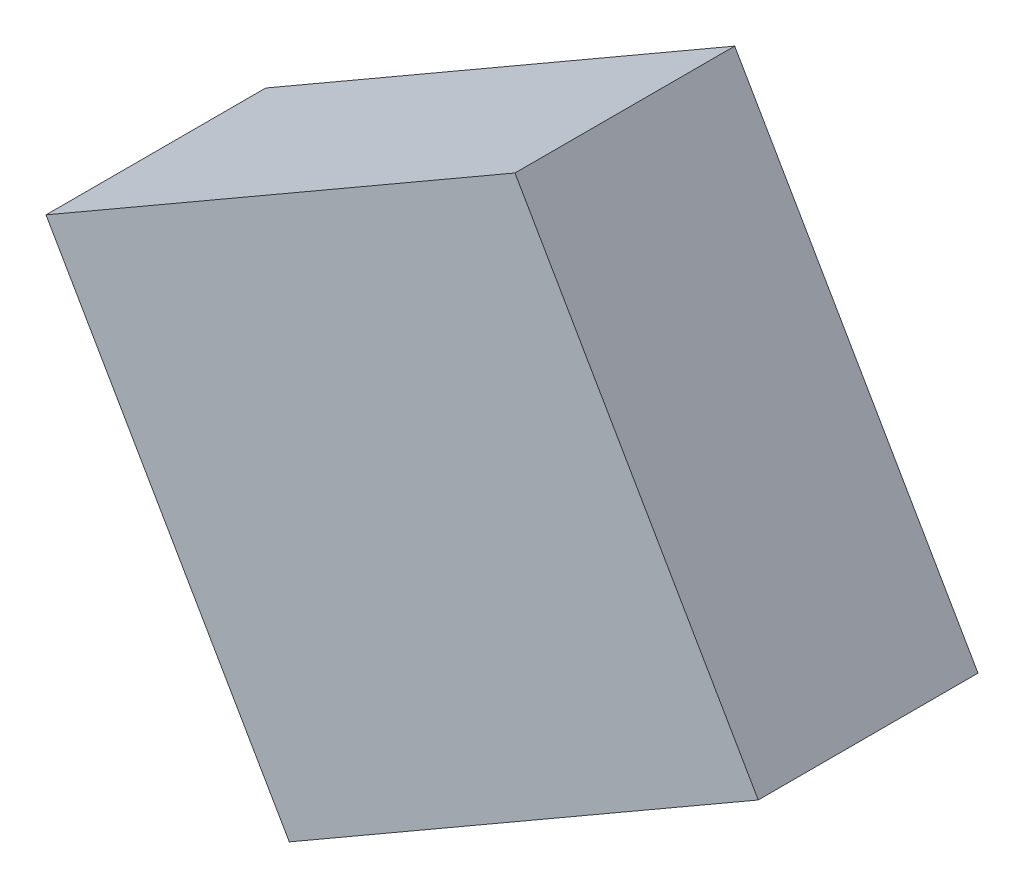
ISO-10303-21;
HEADER;
FILE_DESCRIPTION(('STEP AP214'),'2;1');
FILE_NAME('part.step','',(''),(''),'','','');
FILE_SCHEMA(('AUTOMOTIVE_DESIGN { 1 0 10303 214 1 1 1 1 }'));
ENDSEC;
DATA;
#1=APPLICATION_CONTEXT('core data for automotive mechanical design processes');
#2=APPLICATION_PROTOCOL_DEFINITION('international standard','automotive_design',2000,#1);
#3=PRODUCT_CONTEXT('',#1,'mechanical');
#4=PRODUCT('Part','Part','',(#3));
#5=PRODUCT_RELATED_PRODUCT_CATEGORY('part','',(#4));
#6=PRODUCT_DEFINITION_FORMATION('','',#4);
#7=PRODUCT_DEFINITION_CONTEXT('part definition',#1,'design');
#8=PRODUCT_DEFINITION('design','',#6,#7);
#9=PRODUCT_DEFINITION_SHAPE('','',#8);
#10=(LENGTH_UNIT() NAMED_UNIT(*) SI_UNIT(.MILLI.,.METRE.));
#11=(NAMED_UNIT(*) PLANE_ANGLE_UNIT() SI_UNIT($,.RADIAN.));
#12=(NAMED_UNIT(*) SI_UNIT($,.STERADIAN.) SOLID_ANGLE_UNIT());
#13=UNCERTAINTY_MEASURE_WITH_UNIT(LENGTH_MEASURE(1.E-05),#10,'distance_accuracy_value','');
#14=(GEOMETRIC_REPRESENTATION_CONTEXT(3) GLOBAL_UNCERTAINTY_ASSIGNED_CONTEXT((#13)) GLOBAL_UNIT_ASSIGNED_CONTEXT((#10,
#11,#12)) REPRESENTATION_CONTEXT('',''));
#15=CARTESIAN_POINT('',(0.,0.,0.));
#16=DIRECTION('',(0.,0.,1.));
#17=DIRECTION('',(1.,0.,0.));
#18=AXIS2_PLACEMENT_3D('',#15,#16,#17);
#19=CARTESIAN_POINT('',(2.2688931,-0.47983902,1.39999974));
#20=DIRECTION('',(0.,0.,-1.));
#21=DIRECTION('',(-1.,0.,0.));
#22=AXIS2_PLACEMENT_3D('',#19,#20,#21);
#23=PLANE('',#22);
#24=DIRECTION('',(0.866025294610955,0.500000189093974,0.));
#25=VECTOR('',#24,1.);
#26=CARTESIAN_POINT('',(0.71889366,2.20483938,1.39999974));
#27=LINE('',#26,#25);
#28=CARTESIAN_POINT('',(0.718893659999855,2.20483937999992,1.39999974));
#29=VERTEX_POINT('',#28);
#30=CARTESIAN_POINT('',(-2.26889310000007,0.479839020000115,1.39999974));
#31=VERTEX_POINT('',#30);
#32=EDGE_CURVE('E55',#29,#31,#27,.F.);
#33=ORIENTED_EDGE('',*,*,#32,.T.);
#34=DIRECTION('',(-0.499999913646723,0.866025453640521,0.));
#35=VECTOR('',#34,1.);
#36=CARTESIAN_POINT('',(-2.2688931,0.47983902,1.39999974));
#37=LINE('',#36,#35);
#38=CARTESIAN_POINT('',(-0.718893659999855,-2.20483937999992,1.39999974));
#39=VERTEX_POINT('',#38);
#40=EDGE_CURVE('E57',#31,#39,#37,.F.);
#41=ORIENTED_EDGE('',*,*,#40,.T.);
#42=DIRECTION('',(-0.866025294610955,-0.500000189093974,0.));
#43=VECTOR('',#42,1.);
#44=CARTESIAN_POINT('',(-0.71889366,-2.20483938,1.39999974));
#45=LINE('',#44,#43);
#46=CARTESIAN_POINT('',(2.26889310000013,-0.47983902000023,1.39999974));
#47=VERTEX_POINT('',#46);
#48=EDGE_CURVE('E20',#39,#47,#45,.F.);
#49=ORIENTED_EDGE('',*,*,#48,.T.);
#50=DIRECTION('',(0.499999913646723,-0.866025453640521,0.));
#51=VECTOR('',#50,1.);
#52=CARTESIAN_POINT('',(2.2688931,-0.47983902,1.39999974));
#53=LINE('',#52,#51);
#54=EDGE_CURVE('E80',#47,#29,#53,.F.);
#55=ORIENTED_EDGE('',*,*,#54,.T.);
#56=EDGE_LOOP('',(#33,#41,#49,#55));
#57=FACE_BOUND('',#56,.T.);
#58=ADVANCED_FACE('F17',(#57),#23,.F.);
#59=CARTESIAN_POINT('',(-0.71889366,-2.20483938,0.));
#60=DIRECTION('',(-0.500000189093974,0.866025294610955,0.));
#61=DIRECTION('',(-0.866025294610955,-0.500000189093974,0.));
#62=AXIS2_PLACEMENT_3D('',#59,#60,#61);
#63=PLANE('',#62);
#64=DIRECTION('',(0.,0.,1.));
#65=VECTOR('',#64,1.);
#66=CARTESIAN_POINT('',(2.2688931,-0.47983902,0.));
#67=LINE('',#66,#65);
#68=CARTESIAN_POINT('',(2.26889310000013,-0.47983902000023,0.));
#69=VERTEX_POINT('',#68);
#70=EDGE_CURVE('E68',#69,#47,#67,.T.);
#71=ORIENTED_EDGE('',*,*,#70,.T.);
#72=ORIENTED_EDGE('',*,*,#48,.F.);
#73=DIRECTION('',(0.,0.,1.));
#74=VECTOR('',#73,1.);
#75=CARTESIAN_POINT('',(-0.718893659999419,-2.20483937999967,0.));
#76=LINE('',#75,#74);
#77=CARTESIAN_POINT('',(-0.718893659999855,-2.20483937999992,0.));
#78=VERTEX_POINT('',#77);
#79=EDGE_CURVE('E63',#39,#78,#76,.F.);
#80=ORIENTED_EDGE('',*,*,#79,.T.);
#81=DIRECTION('',(-0.866025294610877,-0.500000189094107,0.));
#82=VECTOR('',#81,1.);
#83=CARTESIAN_POINT('',(2.2688931,-0.47983902,0.));
#84=LINE('',#83,#82);
#85=EDGE_CURVE('E83',#69,#78,#84,.T.);
#86=ORIENTED_EDGE('',*,*,#85,.F.);
#87=EDGE_LOOP('',(#71,#72,#80,#86));
#88=FACE_BOUND('',#87,.T.);
#89=ADVANCED_FACE('F65',(#88),#63,.F.);
#90=CARTESIAN_POINT('',(-2.2688931,0.47983902,0.));
#91=DIRECTION('',(0.866025453640521,0.499999913646723,0.));
#92=DIRECTION('',(-0.499999913646723,0.866025453640521,0.));
#93=AXIS2_PLACEMENT_3D('',#90,#91,#92);
#94=PLANE('',#93);
#95=ORIENTED_EDGE('',*,*,#79,.F.);
#96=ORIENTED_EDGE('',*,*,#40,.F.);
#97=DIRECTION('',(0.,0.,1.));
#98=VECTOR('',#97,1.);
#99=CARTESIAN_POINT('',(-2.26889310000027,0.47983902000046,0.));
#100=LINE('',#99,#98);
#101=CARTESIAN_POINT('',(-2.26889310000007,0.479839020000115,0.));
#102=VERTEX_POINT('',#101);
#103=EDGE_CURVE('E75',#31,#102,#100,.F.);
#104=ORIENTED_EDGE('',*,*,#103,.T.);
#105=DIRECTION('',(-0.499999913646536,0.866025453640629,0.));
#106=VECTOR('',#105,1.);
#107=CARTESIAN_POINT('',(-0.71889366,-2.20483938,0.));
#108=LINE('',#107,#106);
#109=EDGE_CURVE('E72',#78,#102,#108,.T.);
#110=ORIENTED_EDGE('',*,*,#109,.F.);
#111=EDGE_LOOP('',(#95,#96,#104,#110));
#112=FACE_BOUND('',#111,.T.);
#113=ADVANCED_FACE('F70',(#112),#94,.F.);
#114=CARTESIAN_POINT('',(0.71889366,2.20483938,0.));
#115=DIRECTION('',(0.500000189093974,-0.866025294610955,0.));
#116=DIRECTION('',(0.866025294610955,0.500000189093974,0.));
#117=AXIS2_PLACEMENT_3D('',#114,#115,#116);
#118=PLANE('',#117);
#119=ORIENTED_EDGE('',*,*,#103,.F.);
#120=ORIENTED_EDGE('',*,*,#32,.F.);
#121=DIRECTION('',(0.,0.,1.));
#122=VECTOR('',#121,1.);
#123=CARTESIAN_POINT('',(0.718893659999419,2.20483937999967,0.));
#124=LINE('',#123,#122);
#125=CARTESIAN_POINT('',(0.718893659999855,2.20483937999992,0.));
#126=VERTEX_POINT('',#125);
#127=EDGE_CURVE('E35',#29,#126,#124,.F.);
#128=ORIENTED_EDGE('',*,*,#127,.T.);
#129=DIRECTION('',(0.866025294610877,0.500000189094107,0.));
#130=VECTOR('',#129,1.);
#131=CARTESIAN_POINT('',(-2.2688931,0.47983902,0.));
#132=LINE('',#131,#130);
#133=EDGE_CURVE('E26',#102,#126,#132,.T.);
#134=ORIENTED_EDGE('',*,*,#133,.F.);
#135=EDGE_LOOP('',(#119,#120,#128,#134));
#136=FACE_BOUND('',#135,.T.);
#137=ADVANCED_FACE('F89',(#136),#118,.F.);
#138=CARTESIAN_POINT('',(2.2688931,-0.47983902,0.));
#139=DIRECTION('',(-0.866025453640521,-0.499999913646723,0.));
#140=DIRECTION('',(0.499999913646723,-0.866025453640521,0.));
#141=AXIS2_PLACEMENT_3D('',#138,#139,#140);
#142=PLANE('',#141);
#143=ORIENTED_EDGE('',*,*,#127,.F.);
#144=ORIENTED_EDGE('',*,*,#54,.F.);
#145=ORIENTED_EDGE('',*,*,#70,.F.);
#146=DIRECTION('',(0.499999913646536,-0.866025453640629,0.));
#147=VECTOR('',#146,1.);
#148=CARTESIAN_POINT('',(0.71889366,2.20483938,0.));
#149=LINE('',#148,#147);
#150=EDGE_CURVE('E11',#126,#69,#149,.T.);
#151=ORIENTED_EDGE('',*,*,#150,.F.);
#152=EDGE_LOOP('',(#143,#144,#145,#151));
#153=FACE_BOUND('',#152,.T.);
#154=ADVANCED_FACE('F91',(#153),#142,.F.);
#155=CARTESIAN_POINT('',(2.2688931,-0.47983902,0.));
#156=DIRECTION('',(0.,0.,-1.));
#157=DIRECTION('',(-1.,0.,0.));
#158=AXIS2_PLACEMENT_3D('',#155,#156,#157);
#159=PLANE('',#158);
#160=ORIENTED_EDGE('',*,*,#133,.T.);
#161=ORIENTED_EDGE('',*,*,#150,.T.);
#162=ORIENTED_EDGE('',*,*,#85,.T.);
#163=ORIENTED_EDGE('',*,*,#109,.T.);
#164=EDGE_LOOP('',(#160,#161,#162,#163));
#165=FACE_BOUND('',#164,.T.);
#166=ADVANCED_FACE('F88',(#165),#159,.T.);
#167=CLOSED_SHELL('',(#58,#89,#113,#137,#154,#166));
#168=MANIFOLD_SOLID_BREP('B1',#167);
#169=ADVANCED_BREP_SHAPE_REPRESENTATION('',(#18,#168),#14);
#170=SHAPE_DEFINITION_REPRESENTATION(#9,#169);
ENDSEC;
END-ISO-10303-21;
